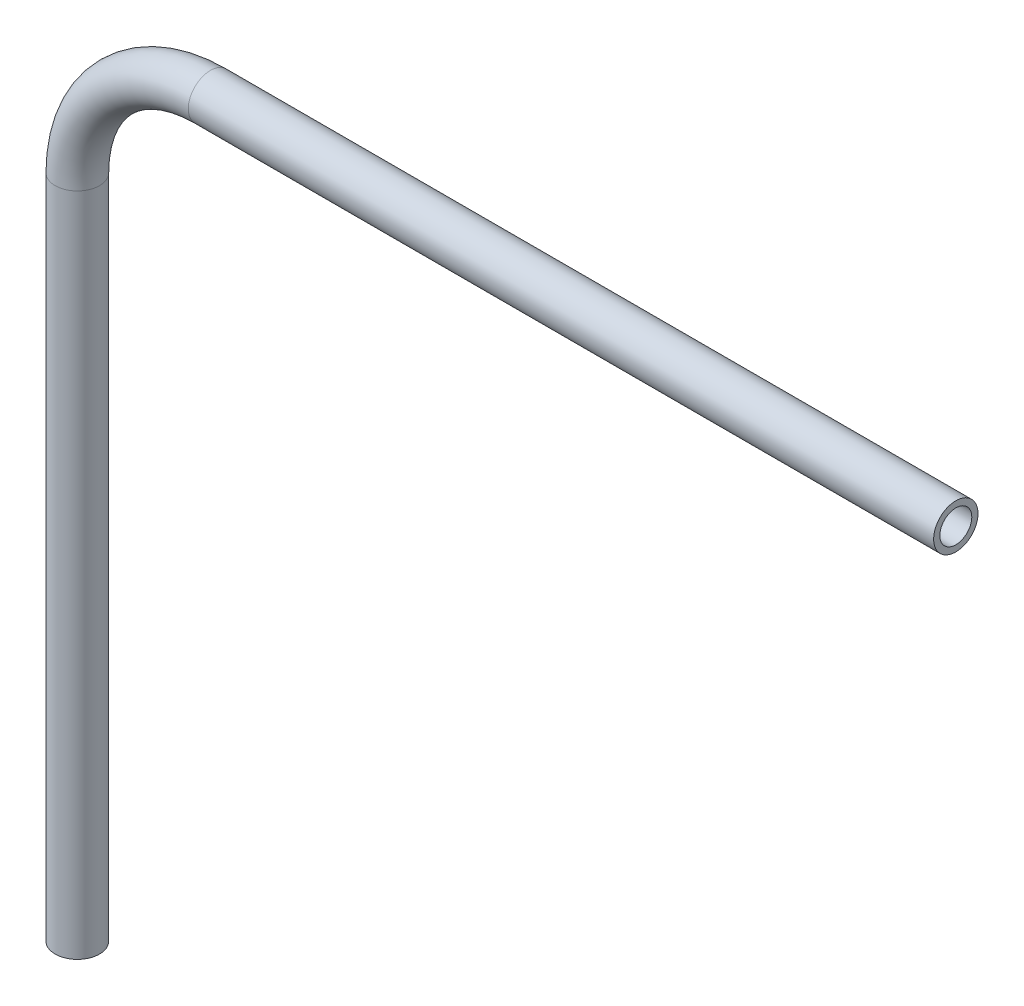
ISO-10303-21;
HEADER;
FILE_DESCRIPTION(('STEP AP214'),'2;1');
FILE_NAME('part.step','',(''),(''),'','','');
FILE_SCHEMA(('AUTOMOTIVE_DESIGN { 1 0 10303 214 1 1 1 1 }'));
ENDSEC;
DATA;
#1=APPLICATION_CONTEXT('core data for automotive mechanical design processes');
#2=APPLICATION_PROTOCOL_DEFINITION('international standard','automotive_design',2000,#1);
#3=PRODUCT_CONTEXT('',#1,'mechanical');
#4=PRODUCT('Part','Part','',(#3));
#5=PRODUCT_RELATED_PRODUCT_CATEGORY('part','',(#4));
#6=PRODUCT_DEFINITION_FORMATION('','',#4);
#7=PRODUCT_DEFINITION_CONTEXT('part definition',#1,'design');
#8=PRODUCT_DEFINITION('design','',#6,#7);
#9=PRODUCT_DEFINITION_SHAPE('','',#8);
#10=(LENGTH_UNIT() NAMED_UNIT(*) SI_UNIT(.MILLI.,.METRE.));
#11=(NAMED_UNIT(*) PLANE_ANGLE_UNIT() SI_UNIT($,.RADIAN.));
#12=(NAMED_UNIT(*) SI_UNIT($,.STERADIAN.) SOLID_ANGLE_UNIT());
#13=UNCERTAINTY_MEASURE_WITH_UNIT(LENGTH_MEASURE(1.E-05),#10,'distance_accuracy_value','');
#14=(GEOMETRIC_REPRESENTATION_CONTEXT(3) GLOBAL_UNCERTAINTY_ASSIGNED_CONTEXT((#13)) GLOBAL_UNIT_ASSIGNED_CONTEXT((#10,
#11,#12)) REPRESENTATION_CONTEXT('',''));
#15=CARTESIAN_POINT('',(0.,0.,0.));
#16=DIRECTION('',(0.,0.,1.));
#17=DIRECTION('',(1.,0.,0.));
#18=AXIS2_PLACEMENT_3D('',#15,#16,#17);
#19=CARTESIAN_POINT('',(0.,-96.7723178807947,0.));
#20=DIRECTION('',(0.,1.,0.));
#21=DIRECTION('',(0.,0.,1.));
#22=AXIS2_PLACEMENT_3D('',#19,#20,#21);
#23=CYLINDRICAL_SURFACE('',#22,3.175);
#24=CARTESIAN_POINT('',(0.,-1.52231788079482,0.));
#25=DIRECTION('',(0.,1.,0.));
#26=DIRECTION('',(0.,0.,-1.));
#27=AXIS2_PLACEMENT_3D('',#24,#25,#26);
#28=CIRCLE('',#27,3.175);
#29=CARTESIAN_POINT('',(-3.175,-1.52231788079484,0.));
#30=VERTEX_POINT('',#29);
#31=EDGE_CURVE('E90',#30,#30,#28,.T.);
#32=ORIENTED_EDGE('',*,*,#31,.F.);
#33=EDGE_LOOP('',(#32));
#34=FACE_BOUND('',#33,.T.);
#35=CARTESIAN_POINT('',(0.,-96.7723178807947,0.));
#36=DIRECTION('',(0.,1.,0.));
#37=DIRECTION('',(0.,0.,-1.));
#38=AXIS2_PLACEMENT_3D('',#35,#36,#37);
#39=CIRCLE('',#38,3.175);
#40=CARTESIAN_POINT('',(0.,-96.7723178807947,-3.175));
#41=VERTEX_POINT('',#40);
#42=EDGE_CURVE('E55',#41,#41,#39,.T.);
#43=ORIENTED_EDGE('',*,*,#42,.T.);
#44=EDGE_LOOP('',(#43));
#45=FACE_BOUND('',#44,.T.);
#46=ADVANCED_FACE('F39',(#34,#45),#23,.T.);
#47=CARTESIAN_POINT('',(19.05,-1.52231788079469,0.));
#48=DIRECTION('',(0.,0.,-1.));
#49=DIRECTION('',(-1.,0.,0.));
#50=AXIS2_PLACEMENT_3D('',#47,#48,#49);
#51=TOROIDAL_SURFACE('',#50,19.05,3.175);
#52=CARTESIAN_POINT('',(19.05,17.5276821192062,0.));
#53=DIRECTION('',(1.,0.,0.));
#54=DIRECTION('',(0.,0.,-1.));
#55=AXIS2_PLACEMENT_3D('',#52,#53,#54);
#56=CIRCLE('',#55,3.175);
#57=CARTESIAN_POINT('',(19.05,20.7026821192053,0.));
#58=VERTEX_POINT('',#57);
#59=EDGE_CURVE('E43',#58,#58,#56,.T.);
#60=CARTESIAN_POINT('',(19.05,-1.52231788079469,0.));
#61=DIRECTION('',(0.,0.,-1.));
#62=DIRECTION('',(-1.,0.,0.));
#63=AXIS2_PLACEMENT_3D('',#60,#61,#62);
#64=CIRCLE('',#63,22.225);
#65=EDGE_CURVE('',#30,#58,#64,.T.);
#66=ORIENTED_EDGE('',*,*,#31,.T.);
#67=ORIENTED_EDGE('',*,*,#59,.F.);
#68=ORIENTED_EDGE('',*,*,#65,.T.);
#69=ORIENTED_EDGE('',*,*,#65,.F.);
#70=EDGE_LOOP('',(#66,#68,#67,#69));
#71=FACE_BOUND('',#70,.T.);
#72=ADVANCED_FACE('F100',(#71),#51,.T.);
#73=CARTESIAN_POINT('',(19.0500000000001,17.5276821192053,0.));
#74=DIRECTION('',(1.,0.,0.));
#75=DIRECTION('',(0.,0.,-1.));
#76=AXIS2_PLACEMENT_3D('',#73,#74,#75);
#77=CYLINDRICAL_SURFACE('',#76,3.175);
#78=CARTESIAN_POINT('',(125.73,17.5276821192053,0.));
#79=DIRECTION('',(1.,0.,0.));
#80=DIRECTION('',(0.,0.,-1.));
#81=AXIS2_PLACEMENT_3D('',#78,#79,#80);
#82=CIRCLE('',#81,3.175);
#83=CARTESIAN_POINT('',(125.73,17.5276821192053,-3.175));
#84=VERTEX_POINT('',#83);
#85=EDGE_CURVE('E60',#84,#84,#82,.T.);
#86=ORIENTED_EDGE('',*,*,#85,.F.);
#87=EDGE_LOOP('',(#86));
#88=FACE_BOUND('',#87,.T.);
#89=ORIENTED_EDGE('',*,*,#59,.T.);
#90=EDGE_LOOP('',(#89));
#91=FACE_BOUND('',#90,.T.);
#92=ADVANCED_FACE('F41',(#88,#91),#77,.T.);
#93=CARTESIAN_POINT('',(0.,-96.7723178807947,0.));
#94=DIRECTION('',(0.,1.,0.));
#95=DIRECTION('',(0.,0.,-1.));
#96=AXIS2_PLACEMENT_3D('',#93,#94,#95);
#97=PLANE('',#96);
#98=CARTESIAN_POINT('',(0.,-96.7723178807947,0.));
#99=DIRECTION('',(0.,1.,0.));
#100=DIRECTION('',(0.,0.,-1.));
#101=AXIS2_PLACEMENT_3D('',#98,#99,#100);
#102=CIRCLE('',#101,2.286);
#103=CARTESIAN_POINT('',(0.,-96.7723178807947,-2.286));
#104=VERTEX_POINT('',#103);
#105=EDGE_CURVE('E83',#104,#104,#102,.F.);
#106=ORIENTED_EDGE('',*,*,#105,.F.);
#107=EDGE_LOOP('',(#106));
#108=FACE_BOUND('',#107,.T.);
#109=ORIENTED_EDGE('',*,*,#42,.F.);
#110=EDGE_LOOP('',(#109));
#111=FACE_BOUND('',#110,.T.);
#112=ADVANCED_FACE('F106',(#108,#111),#97,.F.);
#113=CARTESIAN_POINT('',(125.73,17.5276821192053,0.));
#114=DIRECTION('',(1.,0.,0.));
#115=DIRECTION('',(0.,0.,-1.));
#116=AXIS2_PLACEMENT_3D('',#113,#114,#115);
#117=PLANE('',#116);
#118=CARTESIAN_POINT('',(125.73,17.5276821192053,0.));
#119=DIRECTION('',(1.,0.,0.));
#120=DIRECTION('',(0.,0.,-1.));
#121=AXIS2_PLACEMENT_3D('',#118,#119,#120);
#122=CIRCLE('',#121,2.286);
#123=CARTESIAN_POINT('',(125.73,17.5276821192053,-2.286));
#124=VERTEX_POINT('',#123);
#125=EDGE_CURVE('E11',#124,#124,#122,.F.);
#126=ORIENTED_EDGE('',*,*,#125,.T.);
#127=EDGE_LOOP('',(#126));
#128=FACE_BOUND('',#127,.T.);
#129=ORIENTED_EDGE('',*,*,#85,.T.);
#130=EDGE_LOOP('',(#129));
#131=FACE_BOUND('',#130,.T.);
#132=ADVANCED_FACE('F67',(#128,#131),#117,.T.);
#133=CARTESIAN_POINT('',(0.,-96.7723178807947,0.));
#134=DIRECTION('',(0.,1.,0.));
#135=DIRECTION('',(0.,0.,1.));
#136=AXIS2_PLACEMENT_3D('',#133,#134,#135);
#137=CYLINDRICAL_SURFACE('',#136,2.286);
#138=CARTESIAN_POINT('',(0.,-1.52231788079482,0.));
#139=DIRECTION('',(0.,1.,0.));
#140=DIRECTION('',(0.,0.,-1.));
#141=AXIS2_PLACEMENT_3D('',#138,#139,#140);
#142=CIRCLE('',#141,2.286);
#143=CARTESIAN_POINT('',(-2.286,-1.52231788079484,0.));
#144=VERTEX_POINT('',#143);
#145=EDGE_CURVE('E79',#144,#144,#142,.F.);
#146=ORIENTED_EDGE('',*,*,#145,.F.);
#147=EDGE_LOOP('',(#146));
#148=FACE_BOUND('',#147,.T.);
#149=ORIENTED_EDGE('',*,*,#105,.T.);
#150=EDGE_LOOP('',(#149));
#151=FACE_BOUND('',#150,.T.);
#152=ADVANCED_FACE('F114',(#148,#151),#137,.F.);
#153=CARTESIAN_POINT('',(19.05,-1.52231788079469,0.));
#154=DIRECTION('',(0.,0.,-1.));
#155=DIRECTION('',(-1.,0.,0.));
#156=AXIS2_PLACEMENT_3D('',#153,#154,#155);
#157=TOROIDAL_SURFACE('',#156,19.05,2.286);
#158=CARTESIAN_POINT('',(19.05,17.5276821192062,0.));
#159=DIRECTION('',(1.,0.,0.));
#160=DIRECTION('',(0.,0.,-1.));
#161=AXIS2_PLACEMENT_3D('',#158,#159,#160);
#162=CIRCLE('',#161,2.286);
#163=CARTESIAN_POINT('',(19.05,19.8136821192053,0.));
#164=VERTEX_POINT('',#163);
#165=EDGE_CURVE('E49',#164,#164,#162,.F.);
#166=CARTESIAN_POINT('',(19.05,-1.52231788079469,0.));
#167=DIRECTION('',(0.,0.,-1.));
#168=DIRECTION('',(-1.,0.,0.));
#169=AXIS2_PLACEMENT_3D('',#166,#167,#168);
#170=CIRCLE('',#169,21.336);
#171=EDGE_CURVE('',#144,#164,#170,.T.);
#172=ORIENTED_EDGE('',*,*,#145,.T.);
#173=ORIENTED_EDGE('',*,*,#165,.F.);
#174=ORIENTED_EDGE('',*,*,#171,.T.);
#175=ORIENTED_EDGE('',*,*,#171,.F.);
#176=EDGE_LOOP('',(#172,#174,#173,#175));
#177=FACE_BOUND('',#176,.T.);
#178=ADVANCED_FACE('F73',(#177),#157,.F.);
#179=CARTESIAN_POINT('',(19.0500000000001,17.5276821192053,0.));
#180=DIRECTION('',(1.,0.,0.));
#181=DIRECTION('',(0.,0.,-1.));
#182=AXIS2_PLACEMENT_3D('',#179,#180,#181);
#183=CYLINDRICAL_SURFACE('',#182,2.286);
#184=ORIENTED_EDGE('',*,*,#125,.F.);
#185=EDGE_LOOP('',(#184));
#186=FACE_BOUND('',#185,.T.);
#187=ORIENTED_EDGE('',*,*,#165,.T.);
#188=EDGE_LOOP('',(#187));
#189=FACE_BOUND('',#188,.T.);
#190=ADVANCED_FACE('F70',(#186,#189),#183,.F.);
#191=CLOSED_SHELL('',(#46,#72,#92,#112,#132,#152,#178,#190));
#192=MANIFOLD_SOLID_BREP('B2',#191);
#193=ADVANCED_BREP_SHAPE_REPRESENTATION('',(#18,#192),#14);
#194=SHAPE_DEFINITION_REPRESENTATION(#9,#193);
ENDSEC;
END-ISO-10303-21;
